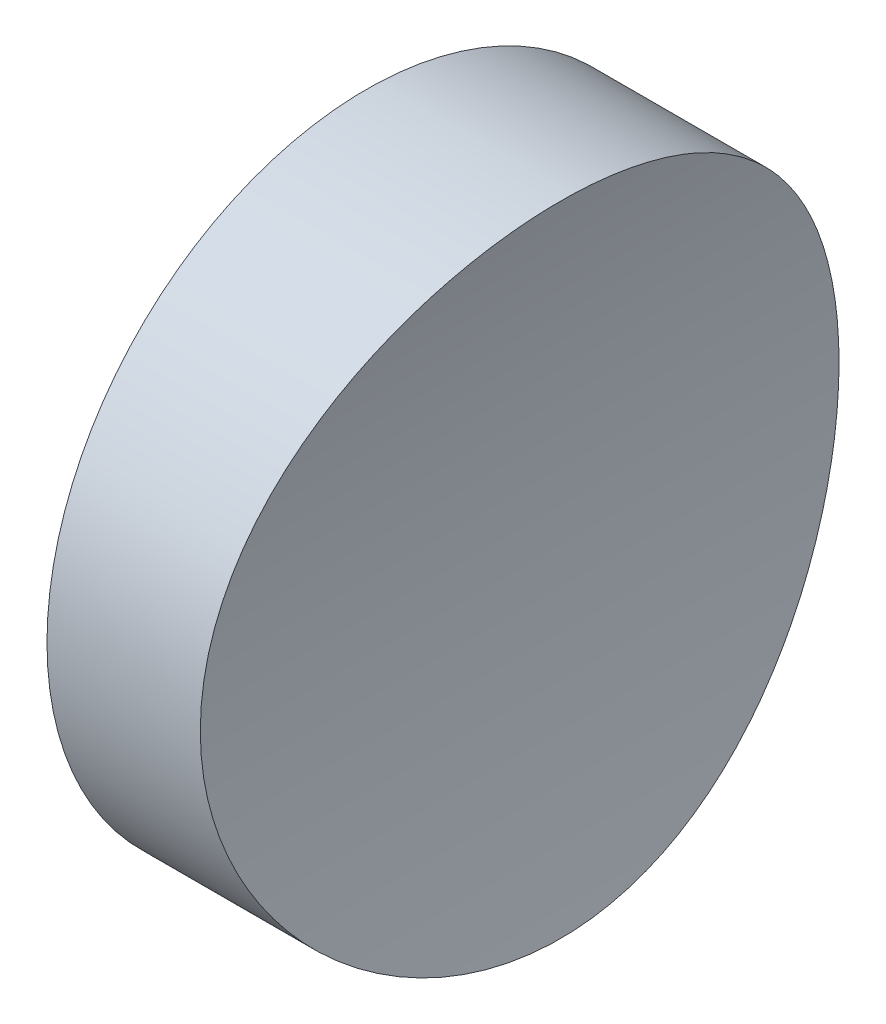
ISO-10303-21;
HEADER;
FILE_DESCRIPTION(('STEP AP214'),'2;1');
FILE_NAME('part.step','',(''),(''),'','','');
FILE_SCHEMA(('AUTOMOTIVE_DESIGN { 1 0 10303 214 1 1 1 1 }'));
ENDSEC;
DATA;
#1=APPLICATION_CONTEXT('core data for automotive mechanical design processes');
#2=APPLICATION_PROTOCOL_DEFINITION('international standard','automotive_design',2000,#1);
#3=PRODUCT_CONTEXT('',#1,'mechanical');
#4=PRODUCT('Part','Part','',(#3));
#5=PRODUCT_RELATED_PRODUCT_CATEGORY('part','',(#4));
#6=PRODUCT_DEFINITION_FORMATION('','',#4);
#7=PRODUCT_DEFINITION_CONTEXT('part definition',#1,'design');
#8=PRODUCT_DEFINITION('design','',#6,#7);
#9=PRODUCT_DEFINITION_SHAPE('','',#8);
#10=(LENGTH_UNIT() NAMED_UNIT(*) SI_UNIT(.MILLI.,.METRE.));
#11=(NAMED_UNIT(*) PLANE_ANGLE_UNIT() SI_UNIT($,.RADIAN.));
#12=(NAMED_UNIT(*) SI_UNIT($,.STERADIAN.) SOLID_ANGLE_UNIT());
#13=UNCERTAINTY_MEASURE_WITH_UNIT(LENGTH_MEASURE(1.E-05),#10,'distance_accuracy_value','');
#14=(GEOMETRIC_REPRESENTATION_CONTEXT(3) GLOBAL_UNCERTAINTY_ASSIGNED_CONTEXT((#13)) GLOBAL_UNIT_ASSIGNED_CONTEXT((#10,
#11,#12)) REPRESENTATION_CONTEXT('',''));
#15=CARTESIAN_POINT('',(0.,0.,0.));
#16=DIRECTION('',(0.,0.,1.));
#17=DIRECTION('',(1.,0.,0.));
#18=AXIS2_PLACEMENT_3D('',#15,#16,#17);
#19=CARTESIAN_POINT('',(10.,0.,0.));
#20=DIRECTION('',(-1.,0.,0.));
#21=DIRECTION('',(0.,0.,1.));
#22=AXIS2_PLACEMENT_3D('',#19,#20,#21);
#23=CYLINDRICAL_SURFACE('',#22,6.25);
#24=CARTESIAN_POINT('',(3.00000000000001,0.,6.25));
#25=CARTESIAN_POINT('',(2.99999687887849,0.172713945212292,6.25000515518082));
#26=CARTESIAN_POINT('',(3.00179246487054,0.345371477183103,6.24283971365372));
#27=CARTESIAN_POINT('',(3.00891780513268,0.689477439062226,6.21425014373295));
#28=CARTESIAN_POINT('',(3.01424796263211,0.860925728762749,6.19282438849984));
#29=CARTESIAN_POINT('',(3.02830075543673,1.20136946134818,6.13587945896304));
#30=CARTESIAN_POINT('',(3.03702444316567,1.37036412641702,6.1003559124912));
#31=CARTESIAN_POINT('',(3.05762649136016,1.70471874326447,6.01549590844116));
#32=CARTESIAN_POINT('',(3.06950601442701,1.87007733116385,5.96615435998424));
#33=CARTESIAN_POINT('',(3.09607249161212,2.19568636278267,5.85414875180168));
#34=CARTESIAN_POINT('',(3.1107549391753,2.35594453086983,5.79150605981015));
#35=CARTESIAN_POINT('',(3.14254926230047,2.67061066480478,5.65330686435857));
#36=CARTESIAN_POINT('',(3.15966203442204,2.82501644492505,5.57774559305992));
#37=CARTESIAN_POINT('',(3.19584906439531,3.12685063576603,5.41430964049058));
#38=CARTESIAN_POINT('',(3.21492260786276,3.27428155930854,5.32643943963362));
#39=CARTESIAN_POINT('',(3.25453838794393,3.5613388193175,5.13894607855176));
#40=CARTESIAN_POINT('',(3.27508117543988,3.70096219306753,5.03931850078737));
#41=CARTESIAN_POINT('',(3.31746826039777,3.97392119377508,4.82709800286526));
#42=CARTESIAN_POINT('',(3.33932940003408,4.10709696784651,4.71430279942074));
#43=CARTESIAN_POINT('',(3.38341623089173,4.36357017543451,4.47796559050908));
#44=CARTESIAN_POINT('',(3.40564205436205,4.48686392548904,4.35441961321802));
#45=CARTESIAN_POINT('',(3.44983372866335,4.72268218254147,4.09745949656411));
#46=CARTESIAN_POINT('',(3.47179964388926,4.83520940818203,3.96404786353149));
#47=CARTESIAN_POINT('',(3.51487517006677,5.04881579478792,3.68814435777727));
#48=CARTESIAN_POINT('',(3.53598446190268,5.14989071413283,3.54564915108387));
#49=CARTESIAN_POINT('',(3.57703876783405,5.34122478473712,3.25041602713142));
#50=CARTESIAN_POINT('',(3.59696241706534,5.43130551119765,3.0975593968851));
#51=CARTESIAN_POINT('',(3.63472386530712,5.59827186706257,2.78448300924311));
#52=CARTESIAN_POINT('',(3.65256087456142,5.67515250558384,2.62426049574567));
#53=CARTESIAN_POINT('',(3.68559080786454,5.81503975996594,2.29767832302142));
#54=CARTESIAN_POINT('',(3.70078504257877,5.87805325727428,2.13132175583627));
#55=CARTESIAN_POINT('',(3.72807967623191,5.9897526673107,1.79362188637554));
#56=CARTESIAN_POINT('',(3.74017896705571,6.03843344928629,1.6222768224046));
#57=CARTESIAN_POINT('',(3.77078843304885,6.16057455537249,1.10956073690328));
#58=CARTESIAN_POINT('',(3.78434040493281,6.21311443845997,0.762517065548305));
#59=CARTESIAN_POINT('',(3.79330615773251,6.24787342030915,0.239428696499592));
#60=CARTESIAN_POINT('',(3.79439927146836,6.25211107931216,0.0645776279505643));
#61=CARTESIAN_POINT('',(3.79280769880882,6.24594761250791,-0.284870467867755));
#62=CARTESIAN_POINT('',(3.79012297504597,6.23554634190361,-0.459467492607142));
#63=CARTESIAN_POINT('',(3.77669228522053,6.18327826536048,-0.972370585178267));
#64=CARTESIAN_POINT('',(3.76071203618374,6.12091004008673,-1.30867941142709));
#65=CARTESIAN_POINT('',(3.7163891048295,5.94260048938626,-1.9657233940192));
#66=CARTESIAN_POINT('',(3.68804554181417,5.82665534738507,-2.28645743908728));
#67=CARTESIAN_POINT('',(3.62186970794273,5.54328957009819,-2.90722749898246));
#68=CARTESIAN_POINT('',(3.58394454231131,5.37536113457974,-3.20702189754726));
#69=CARTESIAN_POINT('',(3.50292886122239,4.99315112894934,-3.7746651095646));
#70=CARTESIAN_POINT('',(3.45983744248379,4.77886144763182,-4.04250832020862));
#71=CARTESIAN_POINT('',(3.37183826994418,4.30276427540704,-4.54668066590711));
#72=CARTESIAN_POINT('',(3.32691376078731,4.03977607730135,-4.78189342297975));
#73=CARTESIAN_POINT('',(3.24141811184816,3.47754965465509,-5.2050887958842));
#74=CARTESIAN_POINT('',(3.20084710506448,3.17831032324404,-5.39306996903601));
#75=CARTESIAN_POINT('',(3.12842782644214,2.55048287004671,-5.71687736606848));
#76=CARTESIAN_POINT('',(3.09660999382967,2.22179747224855,-5.85252223198522));
#77=CARTESIAN_POINT('',(3.04550345953919,1.5453167000495,-6.06632212619447));
#78=CARTESIAN_POINT('',(3.02621236129033,1.19752499481788,-6.14448815151609));
#79=CARTESIAN_POINT('',(3.0026875299433,0.502249878225549,-6.23940652338218));
#80=CARTESIAN_POINT('',(2.99808110298407,0.154986339085779,-6.25767929429157));
#81=CARTESIAN_POINT('',(3.00338313356881,-0.537636984140669,-6.23646247245937));
#82=CARTESIAN_POINT('',(3.01329028452393,-0.882996936788822,-6.19697807932294));
#83=CARTESIAN_POINT('',(3.0462674501361,-1.55672609861917,-6.0626212895951));
#84=CARTESIAN_POINT('',(3.06914023159367,-1.88527125016613,-5.96857834645498));
#85=CARTESIAN_POINT('',(3.12547056757637,-2.52190546409711,-5.72872020557767));
#86=CARTESIAN_POINT('',(3.15892919102648,-2.82999245687798,-5.58289977933141));
#87=CARTESIAN_POINT('',(3.23361212925937,-3.42301276066118,-5.24068385076954));
#88=CARTESIAN_POINT('',(3.27496370741096,-3.7074382142047,-5.04343683251295));
#89=CARTESIAN_POINT('',(3.36064560285072,-4.23969535048607,-4.60503807849459));
#90=CARTESIAN_POINT('',(3.40497643337931,-4.48752070443369,-4.36387876559849));
#91=CARTESIAN_POINT('',(3.49295954380422,-4.94578972161711,-3.83750701289888));
#92=CARTESIAN_POINT('',(3.53656845882613,-5.15516650497359,-3.55135854980946));
#93=CARTESIAN_POINT('',(3.6169656008879,-5.52297777194849,-2.94689004661777));
#94=CARTESIAN_POINT('',(3.653754130658,-5.68141451682545,-2.62857143539214));
#95=CARTESIAN_POINT('',(3.70043130774148,-5.8766757365924,-2.13504154269234));
#96=CARTESIAN_POINT('',(3.71454826888015,-5.934605813943,-1.96828825177471));
#97=CARTESIAN_POINT('',(3.7396005572673,-6.03620592925578,-1.63027621906756));
#98=CARTESIAN_POINT('',(3.75053708975469,-6.07988136985139,-1.45901921088166));
#99=CARTESIAN_POINT('',(3.76888377703938,-6.15259372347521,-1.11324692847986));
#100=CARTESIAN_POINT('',(3.77629387220018,-6.18163038894377,-0.938731599213519));
#101=CARTESIAN_POINT('',(3.78735456350746,-6.22481338607339,-0.587752222536389));
#102=CARTESIAN_POINT('',(3.79100533614084,-6.23896041675081,-0.411288266999857));
#103=CARTESIAN_POINT('',(3.79438140738904,-6.25204528422239,-0.0628448490166894));
#104=CARTESIAN_POINT('',(3.79421650846064,-6.25140854730427,0.109117740986595));
#105=CARTESIAN_POINT('',(3.79023579952763,-6.23597475319135,0.452360937663388));
#106=CARTESIAN_POINT('',(3.78642007260676,-6.22117801824283,0.623641559767713));
#107=CARTESIAN_POINT('',(3.77525211236165,-6.17754766155938,0.964313577512694));
#108=CARTESIAN_POINT('',(3.76789933701186,-6.14871188844137,1.13370467952683));
#109=CARTESIAN_POINT('',(3.74988035711209,-6.07725695737972,1.46931006964419));
#110=CARTESIAN_POINT('',(3.73921532037453,-6.03464265714925,1.6355254555268));
#111=CARTESIAN_POINT('',(3.7149539801115,-5.93625212204908,1.96276290242306));
#112=CARTESIAN_POINT('',(3.70137455271062,-5.88055149628392,2.12380897146906));
#113=CARTESIAN_POINT('',(3.67164289641056,-5.7563109675372,2.44055648290321));
#114=CARTESIAN_POINT('',(3.65549156036052,-5.68777551877122,2.59625975734819));
#115=CARTESIAN_POINT('',(3.62105666852737,-5.53832120356287,2.90144452602798));
#116=CARTESIAN_POINT('',(3.60277215504854,-5.45739676992232,3.05092318452306));
#117=CARTESIAN_POINT('',(3.56458427329613,-5.28378202052753,3.34259526730107));
#118=CARTESIAN_POINT('',(3.54468143663889,-5.19109556301266,3.48479105917507));
#119=CARTESIAN_POINT('',(3.5032443400926,-4.99195094092062,3.76473195737883));
#120=CARTESIAN_POINT('',(3.48168084886517,-4.88519329293203,3.90225977418812));
#121=CARTESIAN_POINT('',(3.4380126220427,-4.66067026234,4.16783867545106));
#122=CARTESIAN_POINT('',(3.4159080728275,-4.54290863199715,4.29589296380024));
#123=CARTESIAN_POINT('',(3.37174386845425,-4.2970460369473,4.54182175555663));
#124=CARTESIAN_POINT('',(3.34968424752742,-4.16893900596864,4.65969020116742));
#125=CARTESIAN_POINT('',(3.3062324417537,-3.90332475522302,4.88434237281621));
#126=CARTESIAN_POINT('',(3.28484001694935,-3.76582097312991,4.99113011695292));
#127=CARTESIAN_POINT('',(3.24291027399709,-3.47962694485495,5.19481582702542));
#128=CARTESIAN_POINT('',(3.22239615284706,-3.33077660271355,5.29149381360289));
#129=CARTESIAN_POINT('',(3.18324220228333,-3.02526721726076,5.47190281388958));
#130=CARTESIAN_POINT('',(3.16460168462992,-2.86861107315439,5.55563858784634));
#131=CARTESIAN_POINT('',(3.1297241968332,-2.5485801342231,5.70953071579057));
#132=CARTESIAN_POINT('',(3.11348619136289,-2.38520827244969,5.77969292313773));
#133=CARTESIAN_POINT('',(3.08387191782267,-2.0529062690692,5.90590245363844));
#134=CARTESIAN_POINT('',(3.07049521809825,-1.88397697029587,5.96195190605829));
#135=CARTESIAN_POINT('',(3.0396823366414,-1.43518365075969,6.08982588948369));
#136=CARTESIAN_POINT('',(3.02489429667598,-1.15165778401843,6.14978685191745));
#137=CARTESIAN_POINT('',(3.00505610828173,-0.578701565046397,6.22986809181151));
#138=CARTESIAN_POINT('',(3.00000522744122,-0.289271658562022,6.24999136579444));
#139=CARTESIAN_POINT('',(3.00000000000001,0.,6.25));
#140=B_SPLINE_CURVE_WITH_KNOTS('',3,(#24,#25,#26,#27,#28,#29,#30,#31,#32,#33,#34,#35,#36,#37,
#38,#39,#40,#41,#42,#43,#44,#45,#46,#47,#48,#49,#50,#51,#52,#53,#54,#55,#56,#57,#58,#59,#60,#61,
#62,#63,#64,#65,#66,#67,#68,#69,#70,#71,#72,#73,#74,#75,#76,#77,#78,#79,#80,#81,#82,#83,#84,#85,
#86,#87,#88,#89,#90,#91,#92,#93,#94,#95,#96,#97,#98,#99,#100,#101,#102,#103,#104,#105,#106,#107,
#108,#109,#110,#111,#112,#113,#114,#115,#116,#117,#118,#119,#120,#121,#122,#123,#124,#125,#126,
#127,#128,#129,#130,#131,#132,#133,#134,#135,#136,#137,#138,#139),.UNSPECIFIED.,.T.,.F.,(4,2,2,
2,2,2,2,2,2,2,2,2,2,2,2,2,2,2,2,2,2,2,2,2,2,2,2,2,2,2,2,2,2,2,2,2,2,2,2,2,2,2,2,2,2,2,2,2,2,2,2,
2,2,2,2,2,2,4),(0.,0.517886930842011,1.03583295318369,1.55393973255113,2.07223764639931,
2.58970915181708,3.10737205349274,3.62484701468604,4.14251702686513,4.66957067536085,
5.19681987487716,5.72393558599022,6.25124589252249,6.78621543582607,7.32138680496869,
7.85629199812451,8.39138844175132,9.43896485557221,9.96315683290583,10.4873539951797,
11.5093731157988,12.5314650516113,13.563874401938,14.5964645253665,15.6584982809022,
16.72056447212,17.7862786159061,18.8517888108865,19.8900319467462,20.928181620224,
21.9509471786112,22.9738160456218,24.014835222416,25.0560341991938,26.1227902907129,
27.1894990217559,27.7202349768929,28.2507695441827,28.7813130831618,29.3118317138634,
29.8271032639039,30.3423630879259,30.8577018967284,31.3728592170866,31.8851102855291,
32.3971839099515,32.9094883223599,33.4216251183441,33.947311711681,34.4728197001647,
34.9986381019405,35.5242651594632,36.0596341752548,36.5948058071005,37.1297461387195,
37.6646057126219,38.5320590093219,39.3994470551923),.UNSPECIFIED.);
#141=CARTESIAN_POINT('',(3.00000000000001,0.,6.25));
#142=VERTEX_POINT('',#141);
#143=EDGE_CURVE('E10',#142,#142,#140,.T.);
#144=ORIENTED_EDGE('',*,*,#143,.T.);
#145=EDGE_LOOP('',(#144));
#146=FACE_BOUND('',#145,.T.);
#147=CARTESIAN_POINT('',(0.,0.,0.));
#148=DIRECTION('',(1.,0.,0.));
#149=DIRECTION('',(0.,0.,-1.));
#150=AXIS2_PLACEMENT_3D('',#147,#148,#149);
#151=CIRCLE('',#150,6.25);
#152=CARTESIAN_POINT('',(0.,0.,-6.25));
#153=VERTEX_POINT('',#152);
#154=EDGE_CURVE('E46',#153,#153,#151,.T.);
#155=ORIENTED_EDGE('',*,*,#154,.T.);
#156=EDGE_LOOP('',(#155));
#157=FACE_BOUND('',#156,.T.);
#158=ADVANCED_FACE('F35',(#146,#157),#23,.T.);
#159=CARTESIAN_POINT('',(0.,0.,0.));
#160=DIRECTION('',(1.,0.,0.));
#161=DIRECTION('',(0.,0.,-1.));
#162=AXIS2_PLACEMENT_3D('',#159,#160,#161);
#163=PLANE('',#162);
#164=ORIENTED_EDGE('',*,*,#154,.F.);
#165=EDGE_LOOP('',(#164));
#166=FACE_BOUND('',#165,.T.);
#167=ADVANCED_FACE('F53',(#166),#163,.F.);
#168=CARTESIAN_POINT('',(28.,0.,-6.25));
#169=DIRECTION('',(0.,0.,1.));
#170=DIRECTION('',(1.,0.,0.));
#171=AXIS2_PLACEMENT_3D('',#168,#169,#170);
#172=CYLINDRICAL_SURFACE('',#171,25.);
#173=ORIENTED_EDGE('',*,*,#143,.F.);
#174=EDGE_LOOP('',(#173));
#175=FACE_BOUND('',#174,.T.);
#176=ADVANCED_FACE('F55',(#175),#172,.F.);
#177=CLOSED_SHELL('',(#158,#167,#176));
#178=MANIFOLD_SOLID_BREP('B2',#177);
#179=ADVANCED_BREP_SHAPE_REPRESENTATION('',(#18,#178),#14);
#180=SHAPE_DEFINITION_REPRESENTATION(#9,#179);
ENDSEC;
END-ISO-10303-21;
